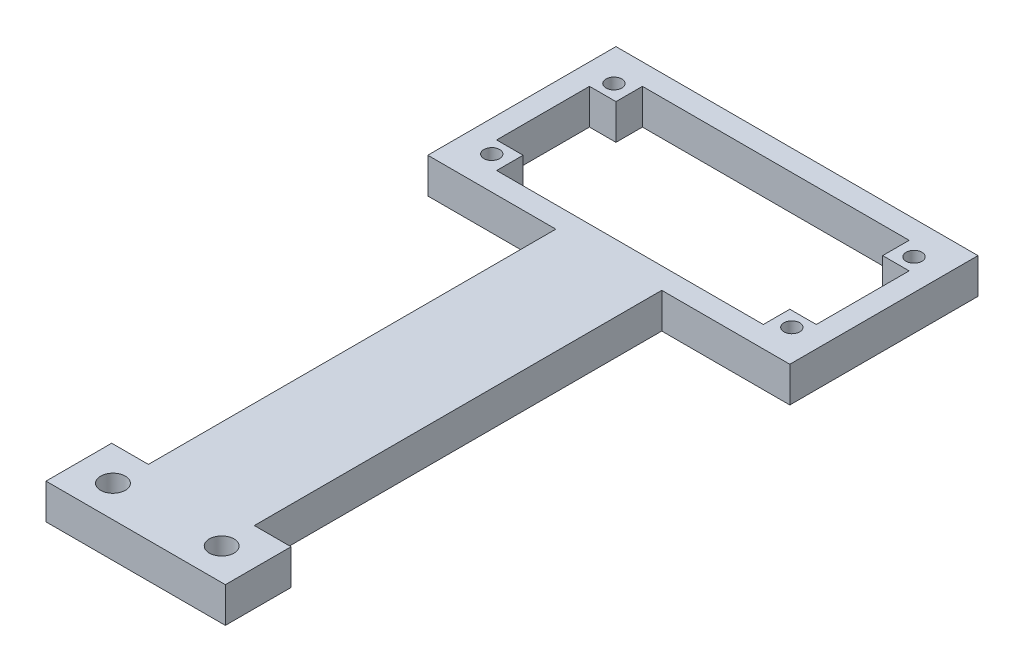
ISO-10303-21;
HEADER;
FILE_DESCRIPTION(('STEP AP214'),'2;1');
FILE_NAME('part.step','',(''),(''),'','','');
FILE_SCHEMA(('AUTOMOTIVE_DESIGN { 1 0 10303 214 1 1 1 1 }'));
ENDSEC;
DATA;
#1=APPLICATION_CONTEXT('core data for automotive mechanical design processes');
#2=APPLICATION_PROTOCOL_DEFINITION('international standard','automotive_design',2000,#1);
#3=PRODUCT_CONTEXT('',#1,'mechanical');
#4=PRODUCT('Part','Part','',(#3));
#5=PRODUCT_RELATED_PRODUCT_CATEGORY('part','',(#4));
#6=PRODUCT_DEFINITION_FORMATION('','',#4);
#7=PRODUCT_DEFINITION_CONTEXT('part definition',#1,'design');
#8=PRODUCT_DEFINITION('design','',#6,#7);
#9=PRODUCT_DEFINITION_SHAPE('','',#8);
#10=(LENGTH_UNIT() NAMED_UNIT(*) SI_UNIT(.MILLI.,.METRE.));
#11=(NAMED_UNIT(*) PLANE_ANGLE_UNIT() SI_UNIT($,.RADIAN.));
#12=(NAMED_UNIT(*) SI_UNIT($,.STERADIAN.) SOLID_ANGLE_UNIT());
#13=UNCERTAINTY_MEASURE_WITH_UNIT(LENGTH_MEASURE(1.E-05),#10,'distance_accuracy_value','');
#14=(GEOMETRIC_REPRESENTATION_CONTEXT(3) GLOBAL_UNCERTAINTY_ASSIGNED_CONTEXT((#13)) GLOBAL_UNIT_ASSIGNED_CONTEXT((#10,
#11,#12)) REPRESENTATION_CONTEXT('',''));
#15=CARTESIAN_POINT('',(0.,0.,0.));
#16=DIRECTION('',(0.,0.,1.));
#17=DIRECTION('',(1.,0.,0.));
#18=AXIS2_PLACEMENT_3D('',#15,#16,#17);
#19=CARTESIAN_POINT('',(-3.,5.,3.));
#20=DIRECTION('',(0.,0.,-1.));
#21=DIRECTION('',(-1.,0.,0.));
#22=AXIS2_PLACEMENT_3D('',#19,#20,#21);
#23=PLANE('',#22);
#24=DIRECTION('',(0.,1.,0.));
#25=VECTOR('',#24,1.);
#26=CARTESIAN_POINT('',(30.135,-59.6178664495804,3.));
#27=LINE('',#26,#25);
#28=CARTESIAN_POINT('',(30.135,0.,3.));
#29=VERTEX_POINT('',#28);
#30=CARTESIAN_POINT('',(30.135,5.,3.));
#31=VERTEX_POINT('',#30);
#32=EDGE_CURVE('E270',#29,#31,#27,.T.);
#33=ORIENTED_EDGE('',*,*,#32,.F.);
#34=DIRECTION('',(1.,0.,0.));
#35=VECTOR('',#34,1.);
#36=CARTESIAN_POINT('',(-3.,0.,3.));
#37=LINE('',#36,#35);
#38=CARTESIAN_POINT('',(48.27,0.,3.));
#39=VERTEX_POINT('',#38);
#40=EDGE_CURVE('E428',#29,#39,#37,.T.);
#41=ORIENTED_EDGE('',*,*,#40,.T.);
#42=DIRECTION('',(0.,-1.,0.));
#43=VECTOR('',#42,1.);
#44=CARTESIAN_POINT('',(48.27,5.,3.));
#45=LINE('',#44,#43);
#46=CARTESIAN_POINT('',(48.27,5.,3.));
#47=VERTEX_POINT('',#46);
#48=EDGE_CURVE('E11',#47,#39,#45,.T.);
#49=ORIENTED_EDGE('',*,*,#48,.F.);
#50=DIRECTION('',(1.,0.,0.));
#51=VECTOR('',#50,1.);
#52=CARTESIAN_POINT('',(-3.,5.,3.));
#53=LINE('',#52,#51);
#54=EDGE_CURVE('E446',#31,#47,#53,.T.);
#55=ORIENTED_EDGE('',*,*,#54,.F.);
#56=EDGE_LOOP('',(#33,#41,#49,#55));
#57=FACE_BOUND('',#56,.T.);
#58=ADVANCED_FACE('F39',(#57),#23,.F.);
#59=CARTESIAN_POINT('',(-3.,0.,3.));
#60=VERTEX_POINT('',#59);
#61=CARTESIAN_POINT('',(15.135,0.,3.));
#62=VERTEX_POINT('',#61);
#63=EDGE_CURVE('E456',#60,#62,#37,.T.);
#64=ORIENTED_EDGE('',*,*,#63,.T.);
#65=DIRECTION('',(0.,1.,0.));
#66=VECTOR('',#65,1.);
#67=CARTESIAN_POINT('',(15.135,-59.6178664495804,3.));
#68=LINE('',#67,#66);
#69=CARTESIAN_POINT('',(15.135,5.,3.));
#70=VERTEX_POINT('',#69);
#71=EDGE_CURVE('E63',#62,#70,#68,.T.);
#72=ORIENTED_EDGE('',*,*,#71,.T.);
#73=CARTESIAN_POINT('',(-3.,5.,3.));
#74=VERTEX_POINT('',#73);
#75=EDGE_CURVE('E442',#74,#70,#53,.T.);
#76=ORIENTED_EDGE('',*,*,#75,.F.);
#77=DIRECTION('',(0.,-1.,0.));
#78=VECTOR('',#77,1.);
#79=CARTESIAN_POINT('',(-3.,5.,3.));
#80=LINE('',#79,#78);
#81=EDGE_CURVE('E455',#74,#60,#80,.T.);
#82=ORIENTED_EDGE('',*,*,#81,.T.);
#83=EDGE_LOOP('',(#64,#72,#76,#82));
#84=FACE_BOUND('',#83,.T.);
#85=ADVANCED_FACE('F41',(#84),#23,.F.);
#86=CARTESIAN_POINT('',(48.27,5.,3.));
#87=DIRECTION('',(-1.,0.,0.));
#88=DIRECTION('',(0.,0.,1.));
#89=AXIS2_PLACEMENT_3D('',#86,#87,#88);
#90=PLANE('',#89);
#91=DIRECTION('',(0.,0.,-1.));
#92=VECTOR('',#91,1.);
#93=CARTESIAN_POINT('',(48.27,0.,3.));
#94=LINE('',#93,#92);
#95=CARTESIAN_POINT('',(48.27,0.,-23.65));
#96=VERTEX_POINT('',#95);
#97=EDGE_CURVE('E459',#39,#96,#94,.T.);
#98=ORIENTED_EDGE('',*,*,#97,.T.);
#99=DIRECTION('',(0.,-1.,0.));
#100=VECTOR('',#99,1.);
#101=CARTESIAN_POINT('',(48.27,5.,-23.65));
#102=LINE('',#101,#100);
#103=CARTESIAN_POINT('',(48.27,5.,-23.65));
#104=VERTEX_POINT('',#103);
#105=EDGE_CURVE('E48',#104,#96,#102,.T.);
#106=ORIENTED_EDGE('',*,*,#105,.F.);
#107=DIRECTION('',(0.,0.,-1.));
#108=VECTOR('',#107,1.);
#109=CARTESIAN_POINT('',(48.27,5.,3.));
#110=LINE('',#109,#108);
#111=EDGE_CURVE('E445',#47,#104,#110,.T.);
#112=ORIENTED_EDGE('',*,*,#111,.F.);
#113=ORIENTED_EDGE('',*,*,#48,.T.);
#114=EDGE_LOOP('',(#98,#106,#112,#113));
#115=FACE_BOUND('',#114,.T.);
#116=ADVANCED_FACE('F538',(#115),#90,.F.);
#117=CARTESIAN_POINT('',(48.27,5.,-23.65));
#118=DIRECTION('',(0.,0.,1.));
#119=DIRECTION('',(1.,0.,0.));
#120=AXIS2_PLACEMENT_3D('',#117,#118,#119);
#121=PLANE('',#120);
#122=DIRECTION('',(-1.,0.,0.));
#123=VECTOR('',#122,1.);
#124=CARTESIAN_POINT('',(48.27,0.,-23.65));
#125=LINE('',#124,#123);
#126=CARTESIAN_POINT('',(-3.,0.,-23.65));
#127=VERTEX_POINT('',#126);
#128=EDGE_CURVE('E462',#96,#127,#125,.T.);
#129=ORIENTED_EDGE('',*,*,#128,.T.);
#130=DIRECTION('',(0.,-1.,0.));
#131=VECTOR('',#130,1.);
#132=CARTESIAN_POINT('',(-3.,5.,-23.65));
#133=LINE('',#132,#131);
#134=CARTESIAN_POINT('',(-3.,5.,-23.65));
#135=VERTEX_POINT('',#134);
#136=EDGE_CURVE('E471',#135,#127,#133,.T.);
#137=ORIENTED_EDGE('',*,*,#136,.F.);
#138=DIRECTION('',(-1.,0.,0.));
#139=VECTOR('',#138,1.);
#140=CARTESIAN_POINT('',(48.27,5.,-23.65));
#141=LINE('',#140,#139);
#142=EDGE_CURVE('E449',#104,#135,#141,.T.);
#143=ORIENTED_EDGE('',*,*,#142,.F.);
#144=ORIENTED_EDGE('',*,*,#105,.T.);
#145=EDGE_LOOP('',(#129,#137,#143,#144));
#146=FACE_BOUND('',#145,.T.);
#147=ADVANCED_FACE('F480',(#146),#121,.F.);
#148=CARTESIAN_POINT('',(-3.,5.,-23.65));
#149=DIRECTION('',(1.,0.,0.));
#150=DIRECTION('',(0.,0.,-1.));
#151=AXIS2_PLACEMENT_3D('',#148,#149,#150);
#152=PLANE('',#151);
#153=DIRECTION('',(0.,0.,1.));
#154=VECTOR('',#153,1.);
#155=CARTESIAN_POINT('',(-3.,0.,-23.65));
#156=LINE('',#155,#154);
#157=EDGE_CURVE('E465',#127,#60,#156,.T.);
#158=ORIENTED_EDGE('',*,*,#157,.T.);
#159=ORIENTED_EDGE('',*,*,#81,.F.);
#160=DIRECTION('',(0.,0.,1.));
#161=VECTOR('',#160,1.);
#162=CARTESIAN_POINT('',(-3.,5.,-23.65));
#163=LINE('',#162,#161);
#164=EDGE_CURVE('E452',#135,#74,#163,.T.);
#165=ORIENTED_EDGE('',*,*,#164,.F.);
#166=ORIENTED_EDGE('',*,*,#136,.T.);
#167=EDGE_LOOP('',(#158,#159,#165,#166));
#168=FACE_BOUND('',#167,.T.);
#169=ADVANCED_FACE('F490',(#168),#152,.F.);
#170=CARTESIAN_POINT('',(0.,5.,0.));
#171=DIRECTION('',(0.,1.,0.));
#172=DIRECTION('',(0.,0.,1.));
#173=AXIS2_PLACEMENT_3D('',#170,#171,#172);
#174=PLANE('',#173);
#175=DIRECTION('',(-1.,0.,0.));
#176=VECTOR('',#175,1.);
#177=CARTESIAN_POINT('',(9.93500000000002,5.,70.));
#178=LINE('',#177,#176);
#179=CARTESIAN_POINT('',(35.335,5.,70.));
#180=VERTEX_POINT('',#179);
#181=CARTESIAN_POINT('',(9.93500000000002,5.,70.));
#182=VERTEX_POINT('',#181);
#183=EDGE_CURVE('E203',#180,#182,#178,.T.);
#184=ORIENTED_EDGE('',*,*,#183,.F.);
#185=DIRECTION('',(0.,0.,-1.));
#186=VECTOR('',#185,1.);
#187=CARTESIAN_POINT('',(35.335,5.,60.7));
#188=LINE('',#187,#186);
#189=CARTESIAN_POINT('',(35.335,5.,60.7));
#190=VERTEX_POINT('',#189);
#191=EDGE_CURVE('E242',#180,#190,#188,.T.);
#192=ORIENTED_EDGE('',*,*,#191,.T.);
#193=DIRECTION('',(-1.,0.,0.));
#194=VECTOR('',#193,1.);
#195=CARTESIAN_POINT('',(9.93500000000002,5.,60.7));
#196=LINE('',#195,#194);
#197=CARTESIAN_POINT('',(30.135,5.,60.7));
#198=VERTEX_POINT('',#197);
#199=EDGE_CURVE('E247',#190,#198,#196,.T.);
#200=ORIENTED_EDGE('',*,*,#199,.T.);
#201=DIRECTION('',(0.,0.,-1.));
#202=VECTOR('',#201,1.);
#203=CARTESIAN_POINT('',(30.135,5.,3.));
#204=LINE('',#203,#202);
#205=EDGE_CURVE('E227',#198,#31,#204,.T.);
#206=ORIENTED_EDGE('',*,*,#205,.T.);
#207=ORIENTED_EDGE('',*,*,#54,.T.);
#208=ORIENTED_EDGE('',*,*,#111,.T.);
#209=ORIENTED_EDGE('',*,*,#142,.T.);
#210=ORIENTED_EDGE('',*,*,#164,.T.);
#211=ORIENTED_EDGE('',*,*,#75,.T.);
#212=DIRECTION('',(0.,0.,1.));
#213=VECTOR('',#212,1.);
#214=CARTESIAN_POINT('',(15.135,5.,3.));
#215=LINE('',#214,#213);
#216=CARTESIAN_POINT('',(15.135,5.,60.7));
#217=VERTEX_POINT('',#216);
#218=EDGE_CURVE('E233',#70,#217,#215,.T.);
#219=ORIENTED_EDGE('',*,*,#218,.T.);
#220=CARTESIAN_POINT('',(9.93500000000002,5.,60.7));
#221=VERTEX_POINT('',#220);
#222=EDGE_CURVE('E246',#217,#221,#196,.T.);
#223=ORIENTED_EDGE('',*,*,#222,.T.);
#224=DIRECTION('',(0.,0.,1.));
#225=VECTOR('',#224,1.);
#226=CARTESIAN_POINT('',(9.93500000000002,5.,60.7));
#227=LINE('',#226,#225);
#228=EDGE_CURVE('E239',#221,#182,#227,.T.);
#229=ORIENTED_EDGE('',*,*,#228,.T.);
#230=EDGE_LOOP('',(#184,#192,#200,#206,#207,#208,#209,#210,#211,#219,#223,#229));
#231=FACE_BOUND('',#230,.T.);
#232=CARTESIAN_POINT('',(30.335,5.,65.5177703204061));
#233=DIRECTION('',(0.,-1.,0.));
#234=DIRECTION('',(0.,0.,-1.));
#235=AXIS2_PLACEMENT_3D('',#232,#233,#234);
#236=CIRCLE('',#235,1.75);
#237=CARTESIAN_POINT('',(30.335,5.,63.7677703204061));
#238=VERTEX_POINT('',#237);
#239=EDGE_CURVE('E243',#238,#238,#236,.T.);
#240=ORIENTED_EDGE('',*,*,#239,.T.);
#241=EDGE_LOOP('',(#240));
#242=FACE_BOUND('',#241,.T.);
#243=CARTESIAN_POINT('',(14.935,5.,65.5177703204061));
#244=DIRECTION('',(0.,-1.,0.));
#245=DIRECTION('',(0.,0.,-1.));
#246=AXIS2_PLACEMENT_3D('',#243,#244,#245);
#247=CIRCLE('',#246,1.75);
#248=CARTESIAN_POINT('',(14.935,5.,63.7677703204061));
#249=VERTEX_POINT('',#248);
#250=EDGE_CURVE('E509',#249,#249,#247,.T.);
#251=ORIENTED_EDGE('',*,*,#250,.T.);
#252=EDGE_LOOP('',(#251));
#253=FACE_BOUND('',#252,.T.);
#254=CARTESIAN_POINT('',(1.385,5.,-1.675));
#255=DIRECTION('',(0.,1.,0.));
#256=DIRECTION('',(0.,0.,1.));
#257=AXIS2_PLACEMENT_3D('',#254,#255,#256);
#258=CIRCLE('',#257,1.12);
#259=CARTESIAN_POINT('',(1.385,5.,-0.555000000000001));
#260=VERTEX_POINT('',#259);
#261=EDGE_CURVE('E265',#260,#260,#258,.T.);
#262=ORIENTED_EDGE('',*,*,#261,.F.);
#263=EDGE_LOOP('',(#262));
#264=FACE_BOUND('',#263,.T.);
#265=CARTESIAN_POINT('',(43.885,5.,-1.675));
#266=DIRECTION('',(0.,1.,0.));
#267=DIRECTION('',(0.,0.,1.));
#268=AXIS2_PLACEMENT_3D('',#265,#266,#267);
#269=CIRCLE('',#268,1.12000000000001);
#270=CARTESIAN_POINT('',(43.885,5.,-0.554999999999996));
#271=VERTEX_POINT('',#270);
#272=EDGE_CURVE('E295',#271,#271,#269,.T.);
#273=ORIENTED_EDGE('',*,*,#272,.F.);
#274=EDGE_LOOP('',(#273));
#275=FACE_BOUND('',#274,.T.);
#276=CARTESIAN_POINT('',(43.885,5.,-18.975));
#277=DIRECTION('',(0.,1.,0.));
#278=DIRECTION('',(0.,0.,1.));
#279=AXIS2_PLACEMENT_3D('',#276,#277,#278);
#280=CIRCLE('',#279,1.12);
#281=CARTESIAN_POINT('',(43.885,5.,-17.855));
#282=VERTEX_POINT('',#281);
#283=EDGE_CURVE('E287',#282,#282,#280,.T.);
#284=ORIENTED_EDGE('',*,*,#283,.F.);
#285=EDGE_LOOP('',(#284));
#286=FACE_BOUND('',#285,.T.);
#287=CARTESIAN_POINT('',(1.385,5.,-18.975));
#288=DIRECTION('',(0.,1.,0.));
#289=DIRECTION('',(0.,0.,1.));
#290=AXIS2_PLACEMENT_3D('',#287,#288,#289);
#291=CIRCLE('',#290,1.12);
#292=CARTESIAN_POINT('',(1.385,5.,-17.855));
#293=VERTEX_POINT('',#292);
#294=EDGE_CURVE('E286',#293,#293,#291,.T.);
#295=ORIENTED_EDGE('',*,*,#294,.F.);
#296=EDGE_LOOP('',(#295));
#297=FACE_BOUND('',#296,.T.);
#298=DIRECTION('',(-1.,0.,0.));
#299=VECTOR('',#298,1.);
#300=CARTESIAN_POINT('',(0.,5.,-20.65));
#301=LINE('',#300,#299);
#302=CARTESIAN_POINT('',(41.52,5.,-20.65));
#303=VERTEX_POINT('',#302);
#304=CARTESIAN_POINT('',(3.75,5.,-20.65));
#305=VERTEX_POINT('',#304);
#306=EDGE_CURVE('E417',#303,#305,#301,.T.);
#307=ORIENTED_EDGE('',*,*,#306,.F.);
#308=DIRECTION('',(0.,0.,1.));
#309=VECTOR('',#308,1.);
#310=CARTESIAN_POINT('',(41.52,5.,-20.65));
#311=LINE('',#310,#309);
#312=CARTESIAN_POINT('',(41.52,5.,-16.9));
#313=VERTEX_POINT('',#312);
#314=EDGE_CURVE('E310',#303,#313,#311,.T.);
#315=ORIENTED_EDGE('',*,*,#314,.T.);
#316=DIRECTION('',(1.,0.,0.));
#317=VECTOR('',#316,1.);
#318=CARTESIAN_POINT('',(45.27,5.,-16.9));
#319=LINE('',#318,#317);
#320=CARTESIAN_POINT('',(45.27,5.,-16.9));
#321=VERTEX_POINT('',#320);
#322=EDGE_CURVE('E325',#313,#321,#319,.T.);
#323=ORIENTED_EDGE('',*,*,#322,.T.);
#324=DIRECTION('',(0.,0.,-1.));
#325=VECTOR('',#324,1.);
#326=CARTESIAN_POINT('',(45.27,5.,0.));
#327=LINE('',#326,#325);
#328=CARTESIAN_POINT('',(45.27,5.,-3.75));
#329=VERTEX_POINT('',#328);
#330=EDGE_CURVE('E436',#329,#321,#327,.T.);
#331=ORIENTED_EDGE('',*,*,#330,.F.);
#332=DIRECTION('',(-1.,0.,0.));
#333=VECTOR('',#332,1.);
#334=CARTESIAN_POINT('',(45.27,5.,-3.75));
#335=LINE('',#334,#333);
#336=CARTESIAN_POINT('',(41.52,5.,-3.75));
#337=VERTEX_POINT('',#336);
#338=EDGE_CURVE('E321',#329,#337,#335,.T.);
#339=ORIENTED_EDGE('',*,*,#338,.T.);
#340=DIRECTION('',(0.,0.,1.));
#341=VECTOR('',#340,1.);
#342=CARTESIAN_POINT('',(41.52,5.,0.));
#343=LINE('',#342,#341);
#344=CARTESIAN_POINT('',(41.52,5.,0.));
#345=VERTEX_POINT('',#344);
#346=EDGE_CURVE('E346',#337,#345,#343,.T.);
#347=ORIENTED_EDGE('',*,*,#346,.T.);
#348=DIRECTION('',(1.,0.,0.));
#349=VECTOR('',#348,1.);
#350=CARTESIAN_POINT('',(0.,5.,0.));
#351=LINE('',#350,#349);
#352=CARTESIAN_POINT('',(3.75,5.,0.));
#353=VERTEX_POINT('',#352);
#354=EDGE_CURVE('E432',#353,#345,#351,.T.);
#355=ORIENTED_EDGE('',*,*,#354,.F.);
#356=DIRECTION('',(0.,0.,-1.));
#357=VECTOR('',#356,1.);
#358=CARTESIAN_POINT('',(3.75,5.,0.));
#359=LINE('',#358,#357);
#360=CARTESIAN_POINT('',(3.75,5.,-3.74999999999999));
#361=VERTEX_POINT('',#360);
#362=EDGE_CURVE('E361',#353,#361,#359,.T.);
#363=ORIENTED_EDGE('',*,*,#362,.T.);
#364=DIRECTION('',(-1.,0.,0.));
#365=VECTOR('',#364,1.);
#366=CARTESIAN_POINT('',(0.,5.,-3.74999999999999));
#367=LINE('',#366,#365);
#368=CARTESIAN_POINT('',(0.,5.,-3.74999999999999));
#369=VERTEX_POINT('',#368);
#370=EDGE_CURVE('E374',#361,#369,#367,.T.);
#371=ORIENTED_EDGE('',*,*,#370,.T.);
#372=DIRECTION('',(0.,0.,1.));
#373=VECTOR('',#372,1.);
#374=CARTESIAN_POINT('',(0.,5.,0.));
#375=LINE('',#374,#373);
#376=CARTESIAN_POINT('',(0.,5.,-16.9));
#377=VERTEX_POINT('',#376);
#378=EDGE_CURVE('E411',#377,#369,#375,.T.);
#379=ORIENTED_EDGE('',*,*,#378,.F.);
#380=DIRECTION('',(1.,0.,0.));
#381=VECTOR('',#380,1.);
#382=CARTESIAN_POINT('',(0.,5.,-16.9));
#383=LINE('',#382,#381);
#384=CARTESIAN_POINT('',(3.75,5.,-16.9));
#385=VERTEX_POINT('',#384);
#386=EDGE_CURVE('E370',#377,#385,#383,.T.);
#387=ORIENTED_EDGE('',*,*,#386,.T.);
#388=DIRECTION('',(0.,0.,-1.));
#389=VECTOR('',#388,1.);
#390=CARTESIAN_POINT('',(3.75,5.,-20.65));
#391=LINE('',#390,#389);
#392=EDGE_CURVE('E395',#385,#305,#391,.T.);
#393=ORIENTED_EDGE('',*,*,#392,.T.);
#394=EDGE_LOOP('',(#307,#315,#323,#331,#339,#347,#355,#363,#371,#379,#387,#393));
#395=FACE_BOUND('',#394,.T.);
#396=ADVANCED_FACE('F494',(#231,#242,#253,#264,#275,#286,#297,#395),#174,.T.);
#397=CARTESIAN_POINT('',(0.,0.,0.));
#398=DIRECTION('',(0.,1.,0.));
#399=DIRECTION('',(0.,0.,1.));
#400=AXIS2_PLACEMENT_3D('',#397,#398,#399);
#401=PLANE('',#400);
#402=CARTESIAN_POINT('',(30.335,0.,65.5177703204061));
#403=DIRECTION('',(0.,-1.,0.));
#404=DIRECTION('',(0.,0.,-1.));
#405=AXIS2_PLACEMENT_3D('',#402,#403,#404);
#406=CIRCLE('',#405,1.75);
#407=CARTESIAN_POINT('',(30.335,0.,63.7677703204061));
#408=VERTEX_POINT('',#407);
#409=EDGE_CURVE('E505',#408,#408,#406,.T.);
#410=ORIENTED_EDGE('',*,*,#409,.F.);
#411=EDGE_LOOP('',(#410));
#412=FACE_BOUND('',#411,.T.);
#413=CARTESIAN_POINT('',(14.935,0.,65.5177703204061));
#414=DIRECTION('',(0.,-1.,0.));
#415=DIRECTION('',(0.,0.,-1.));
#416=AXIS2_PLACEMENT_3D('',#413,#414,#415);
#417=CIRCLE('',#416,1.75);
#418=CARTESIAN_POINT('',(14.935,0.,63.7677703204061));
#419=VERTEX_POINT('',#418);
#420=EDGE_CURVE('E209',#419,#419,#417,.T.);
#421=ORIENTED_EDGE('',*,*,#420,.F.);
#422=EDGE_LOOP('',(#421));
#423=FACE_BOUND('',#422,.T.);
#424=CARTESIAN_POINT('',(1.385,0.,-1.675));
#425=DIRECTION('',(0.,1.,0.));
#426=DIRECTION('',(0.,0.,1.));
#427=AXIS2_PLACEMENT_3D('',#424,#425,#426);
#428=CIRCLE('',#427,1.12);
#429=CARTESIAN_POINT('',(1.385,0.,-0.555000000000001));
#430=VERTEX_POINT('',#429);
#431=EDGE_CURVE('E299',#430,#430,#428,.T.);
#432=ORIENTED_EDGE('',*,*,#431,.T.);
#433=EDGE_LOOP('',(#432));
#434=FACE_BOUND('',#433,.T.);
#435=CARTESIAN_POINT('',(43.885,0.,-1.675));
#436=DIRECTION('',(0.,1.,0.));
#437=DIRECTION('',(0.,0.,1.));
#438=AXIS2_PLACEMENT_3D('',#435,#436,#437);
#439=CIRCLE('',#438,1.12000000000001);
#440=CARTESIAN_POINT('',(43.885,0.,-0.554999999999996));
#441=VERTEX_POINT('',#440);
#442=EDGE_CURVE('E291',#441,#441,#439,.T.);
#443=ORIENTED_EDGE('',*,*,#442,.T.);
#444=EDGE_LOOP('',(#443));
#445=FACE_BOUND('',#444,.T.);
#446=CARTESIAN_POINT('',(43.885,0.,-18.975));
#447=DIRECTION('',(0.,1.,0.));
#448=DIRECTION('',(0.,0.,1.));
#449=AXIS2_PLACEMENT_3D('',#446,#447,#448);
#450=CIRCLE('',#449,1.12);
#451=CARTESIAN_POINT('',(43.885,0.,-17.855));
#452=VERTEX_POINT('',#451);
#453=EDGE_CURVE('E282',#452,#452,#450,.T.);
#454=ORIENTED_EDGE('',*,*,#453,.T.);
#455=EDGE_LOOP('',(#454));
#456=FACE_BOUND('',#455,.T.);
#457=CARTESIAN_POINT('',(1.385,0.,-18.975));
#458=DIRECTION('',(0.,1.,0.));
#459=DIRECTION('',(0.,0.,1.));
#460=AXIS2_PLACEMENT_3D('',#457,#458,#459);
#461=CIRCLE('',#460,1.12);
#462=CARTESIAN_POINT('',(1.385,0.,-17.855));
#463=VERTEX_POINT('',#462);
#464=EDGE_CURVE('E306',#463,#463,#461,.T.);
#465=ORIENTED_EDGE('',*,*,#464,.T.);
#466=EDGE_LOOP('',(#465));
#467=FACE_BOUND('',#466,.T.);
#468=DIRECTION('',(0.,0.,-1.));
#469=VECTOR('',#468,1.);
#470=CARTESIAN_POINT('',(41.52,0.,-20.65));
#471=LINE('',#470,#469);
#472=CARTESIAN_POINT('',(41.52,0.,-16.9));
#473=VERTEX_POINT('',#472);
#474=CARTESIAN_POINT('',(41.52,0.,-20.65));
#475=VERTEX_POINT('',#474);
#476=EDGE_CURVE('E314',#473,#475,#471,.T.);
#477=ORIENTED_EDGE('',*,*,#476,.T.);
#478=DIRECTION('',(-1.,0.,0.));
#479=VECTOR('',#478,1.);
#480=CARTESIAN_POINT('',(0.,0.,-20.65));
#481=LINE('',#480,#479);
#482=CARTESIAN_POINT('',(3.75,0.,-20.65));
#483=VERTEX_POINT('',#482);
#484=EDGE_CURVE('E425',#475,#483,#481,.T.);
#485=ORIENTED_EDGE('',*,*,#484,.T.);
#486=DIRECTION('',(0.,0.,1.));
#487=VECTOR('',#486,1.);
#488=CARTESIAN_POINT('',(3.75,0.,-20.65));
#489=LINE('',#488,#487);
#490=CARTESIAN_POINT('',(3.75,0.,-16.9));
#491=VERTEX_POINT('',#490);
#492=EDGE_CURVE('E387',#483,#491,#489,.T.);
#493=ORIENTED_EDGE('',*,*,#492,.T.);
#494=DIRECTION('',(-1.,0.,0.));
#495=VECTOR('',#494,1.);
#496=CARTESIAN_POINT('',(0.,0.,-16.9));
#497=LINE('',#496,#495);
#498=CARTESIAN_POINT('',(0.,0.,-16.9));
#499=VERTEX_POINT('',#498);
#500=EDGE_CURVE('E390',#491,#499,#497,.T.);
#501=ORIENTED_EDGE('',*,*,#500,.T.);
#502=DIRECTION('',(0.,0.,1.));
#503=VECTOR('',#502,1.);
#504=CARTESIAN_POINT('',(0.,0.,0.));
#505=LINE('',#504,#503);
#506=CARTESIAN_POINT('',(0.,0.,-3.74999999999999));
#507=VERTEX_POINT('',#506);
#508=EDGE_CURVE('E412',#499,#507,#505,.T.);
#509=ORIENTED_EDGE('',*,*,#508,.T.);
#510=DIRECTION('',(1.,0.,0.));
#511=VECTOR('',#510,1.);
#512=CARTESIAN_POINT('',(0.,0.,-3.74999999999999));
#513=LINE('',#512,#511);
#514=CARTESIAN_POINT('',(3.75,0.,-3.74999999999999));
#515=VERTEX_POINT('',#514);
#516=EDGE_CURVE('E366',#507,#515,#513,.T.);
#517=ORIENTED_EDGE('',*,*,#516,.T.);
#518=DIRECTION('',(0.,0.,1.));
#519=VECTOR('',#518,1.);
#520=CARTESIAN_POINT('',(3.75,0.,0.));
#521=LINE('',#520,#519);
#522=CARTESIAN_POINT('',(3.75,0.,0.));
#523=VERTEX_POINT('',#522);
#524=EDGE_CURVE('E362',#515,#523,#521,.T.);
#525=ORIENTED_EDGE('',*,*,#524,.T.);
#526=DIRECTION('',(1.,0.,0.));
#527=VECTOR('',#526,1.);
#528=CARTESIAN_POINT('',(0.,0.,0.));
#529=LINE('',#528,#527);
#530=CARTESIAN_POINT('',(41.52,0.,0.));
#531=VERTEX_POINT('',#530);
#532=EDGE_CURVE('E416',#523,#531,#529,.T.);
#533=ORIENTED_EDGE('',*,*,#532,.T.);
#534=DIRECTION('',(0.,0.,-1.));
#535=VECTOR('',#534,1.);
#536=CARTESIAN_POINT('',(41.52,0.,0.));
#537=LINE('',#536,#535);
#538=CARTESIAN_POINT('',(41.52,0.,-3.75));
#539=VERTEX_POINT('',#538);
#540=EDGE_CURVE('E338',#531,#539,#537,.T.);
#541=ORIENTED_EDGE('',*,*,#540,.T.);
#542=DIRECTION('',(1.,0.,0.));
#543=VECTOR('',#542,1.);
#544=CARTESIAN_POINT('',(45.27,0.,-3.75));
#545=LINE('',#544,#543);
#546=CARTESIAN_POINT('',(45.27,0.,-3.75));
#547=VERTEX_POINT('',#546);
#548=EDGE_CURVE('E341',#539,#547,#545,.T.);
#549=ORIENTED_EDGE('',*,*,#548,.T.);
#550=DIRECTION('',(0.,0.,-1.));
#551=VECTOR('',#550,1.);
#552=CARTESIAN_POINT('',(45.27,0.,0.));
#553=LINE('',#552,#551);
#554=CARTESIAN_POINT('',(45.27,0.,-16.9));
#555=VERTEX_POINT('',#554);
#556=EDGE_CURVE('E421',#547,#555,#553,.T.);
#557=ORIENTED_EDGE('',*,*,#556,.T.);
#558=DIRECTION('',(-1.,0.,0.));
#559=VECTOR('',#558,1.);
#560=CARTESIAN_POINT('',(45.27,0.,-16.9));
#561=LINE('',#560,#559);
#562=EDGE_CURVE('E317',#555,#473,#561,.T.);
#563=ORIENTED_EDGE('',*,*,#562,.T.);
#564=EDGE_LOOP('',(#477,#485,#493,#501,#509,#517,#525,#533,#541,#549,#557,#563));
#565=FACE_BOUND('',#564,.T.);
#566=DIRECTION('',(0.,0.,1.));
#567=VECTOR('',#566,1.);
#568=CARTESIAN_POINT('',(35.335,0.,60.7));
#569=LINE('',#568,#567);
#570=CARTESIAN_POINT('',(35.335,0.,60.7));
#571=VERTEX_POINT('',#570);
#572=CARTESIAN_POINT('',(35.335,0.,70.));
#573=VERTEX_POINT('',#572);
#574=EDGE_CURVE('E219',#571,#573,#569,.T.);
#575=ORIENTED_EDGE('',*,*,#574,.T.);
#576=DIRECTION('',(-1.,0.,0.));
#577=VECTOR('',#576,1.);
#578=CARTESIAN_POINT('',(9.93500000000002,0.,70.));
#579=LINE('',#578,#577);
#580=CARTESIAN_POINT('',(9.93500000000002,0.,70.));
#581=VERTEX_POINT('',#580);
#582=EDGE_CURVE('E55',#573,#581,#579,.T.);
#583=ORIENTED_EDGE('',*,*,#582,.T.);
#584=DIRECTION('',(0.,0.,-1.));
#585=VECTOR('',#584,1.);
#586=CARTESIAN_POINT('',(9.93500000000002,0.,60.7));
#587=LINE('',#586,#585);
#588=CARTESIAN_POINT('',(9.93500000000002,0.,60.7));
#589=VERTEX_POINT('',#588);
#590=EDGE_CURVE('E216',#581,#589,#587,.T.);
#591=ORIENTED_EDGE('',*,*,#590,.T.);
#592=DIRECTION('',(1.,0.,0.));
#593=VECTOR('',#592,1.);
#594=CARTESIAN_POINT('',(9.93500000000002,0.,60.7));
#595=LINE('',#594,#593);
#596=CARTESIAN_POINT('',(15.135,0.,60.7));
#597=VERTEX_POINT('',#596);
#598=EDGE_CURVE('E228',#589,#597,#595,.T.);
#599=ORIENTED_EDGE('',*,*,#598,.T.);
#600=DIRECTION('',(0.,0.,-1.));
#601=VECTOR('',#600,1.);
#602=CARTESIAN_POINT('',(15.135,0.,3.));
#603=LINE('',#602,#601);
#604=EDGE_CURVE('E257',#597,#62,#603,.T.);
#605=ORIENTED_EDGE('',*,*,#604,.T.);
#606=ORIENTED_EDGE('',*,*,#63,.F.);
#607=ORIENTED_EDGE('',*,*,#157,.F.);
#608=ORIENTED_EDGE('',*,*,#128,.F.);
#609=ORIENTED_EDGE('',*,*,#97,.F.);
#610=ORIENTED_EDGE('',*,*,#40,.F.);
#611=DIRECTION('',(0.,0.,1.));
#612=VECTOR('',#611,1.);
#613=CARTESIAN_POINT('',(30.135,0.,3.));
#614=LINE('',#613,#612);
#615=CARTESIAN_POINT('',(30.135,0.,60.7));
#616=VERTEX_POINT('',#615);
#617=EDGE_CURVE('E261',#29,#616,#614,.T.);
#618=ORIENTED_EDGE('',*,*,#617,.T.);
#619=EDGE_CURVE('E235',#616,#571,#595,.T.);
#620=ORIENTED_EDGE('',*,*,#619,.T.);
#621=EDGE_LOOP('',(#575,#583,#591,#599,#605,#606,#607,#608,#609,#610,#618,#620));
#622=FACE_BOUND('',#621,.T.);
#623=ADVANCED_FACE('F214',(#412,#423,#434,#445,#456,#467,#565,#622),#401,.F.);
#624=CARTESIAN_POINT('',(0.,0.,0.));
#625=DIRECTION('',(-1.,0.,0.));
#626=DIRECTION('',(0.,0.,1.));
#627=AXIS2_PLACEMENT_3D('',#624,#625,#626);
#628=PLANE('',#627);
#629=ORIENTED_EDGE('',*,*,#378,.T.);
#630=DIRECTION('',(0.,1.,0.));
#631=VECTOR('',#630,1.);
#632=CARTESIAN_POINT('',(0.,-5.30330085889911,-3.74999999999999));
#633=LINE('',#632,#631);
#634=EDGE_CURVE('E367',#507,#369,#633,.T.);
#635=ORIENTED_EDGE('',*,*,#634,.F.);
#636=ORIENTED_EDGE('',*,*,#508,.F.);
#637=DIRECTION('',(0.,1.,0.));
#638=VECTOR('',#637,1.);
#639=CARTESIAN_POINT('',(0.,-5.30330085889911,-16.9));
#640=LINE('',#639,#638);
#641=EDGE_CURVE('E399',#499,#377,#640,.T.);
#642=ORIENTED_EDGE('',*,*,#641,.T.);
#643=EDGE_LOOP('',(#629,#635,#636,#642));
#644=FACE_BOUND('',#643,.T.);
#645=ADVANCED_FACE('F633',(#644),#628,.F.);
#646=CARTESIAN_POINT('',(0.,0.,-20.65));
#647=DIRECTION('',(0.,0.,-1.));
#648=DIRECTION('',(-1.,0.,0.));
#649=AXIS2_PLACEMENT_3D('',#646,#647,#648);
#650=PLANE('',#649);
#651=ORIENTED_EDGE('',*,*,#484,.F.);
#652=DIRECTION('',(0.,1.,0.));
#653=VECTOR('',#652,1.);
#654=CARTESIAN_POINT('',(41.52,-5.30330085889911,-20.65));
#655=LINE('',#654,#653);
#656=EDGE_CURVE('E329',#475,#303,#655,.T.);
#657=ORIENTED_EDGE('',*,*,#656,.T.);
#658=ORIENTED_EDGE('',*,*,#306,.T.);
#659=DIRECTION('',(0.,1.,0.));
#660=VECTOR('',#659,1.);
#661=CARTESIAN_POINT('',(3.75,-5.30330085889911,-20.65));
#662=LINE('',#661,#660);
#663=EDGE_CURVE('E391',#483,#305,#662,.T.);
#664=ORIENTED_EDGE('',*,*,#663,.F.);
#665=EDGE_LOOP('',(#651,#657,#658,#664));
#666=FACE_BOUND('',#665,.T.);
#667=ADVANCED_FACE('F704',(#666),#650,.F.);
#668=CARTESIAN_POINT('',(45.27,0.,0.));
#669=DIRECTION('',(1.,0.,0.));
#670=DIRECTION('',(0.,0.,-1.));
#671=AXIS2_PLACEMENT_3D('',#668,#669,#670);
#672=PLANE('',#671);
#673=ORIENTED_EDGE('',*,*,#330,.T.);
#674=DIRECTION('',(0.,1.,0.));
#675=VECTOR('',#674,1.);
#676=CARTESIAN_POINT('',(45.27,-5.30330085889911,-16.9));
#677=LINE('',#676,#675);
#678=EDGE_CURVE('E318',#555,#321,#677,.T.);
#679=ORIENTED_EDGE('',*,*,#678,.F.);
#680=ORIENTED_EDGE('',*,*,#556,.F.);
#681=DIRECTION('',(0.,1.,0.));
#682=VECTOR('',#681,1.);
#683=CARTESIAN_POINT('',(45.27,-5.30330085889911,-3.75));
#684=LINE('',#683,#682);
#685=EDGE_CURVE('E350',#547,#329,#684,.T.);
#686=ORIENTED_EDGE('',*,*,#685,.T.);
#687=EDGE_LOOP('',(#673,#679,#680,#686));
#688=FACE_BOUND('',#687,.T.);
#689=ADVANCED_FACE('F707',(#688),#672,.F.);
#690=CARTESIAN_POINT('',(0.,0.,0.));
#691=DIRECTION('',(0.,0.,1.));
#692=DIRECTION('',(1.,0.,0.));
#693=AXIS2_PLACEMENT_3D('',#690,#691,#692);
#694=PLANE('',#693);
#695=ORIENTED_EDGE('',*,*,#354,.T.);
#696=DIRECTION('',(0.,1.,0.));
#697=VECTOR('',#696,1.);
#698=CARTESIAN_POINT('',(41.52,-5.30330085889911,0.));
#699=LINE('',#698,#697);
#700=EDGE_CURVE('E342',#531,#345,#699,.T.);
#701=ORIENTED_EDGE('',*,*,#700,.F.);
#702=ORIENTED_EDGE('',*,*,#532,.F.);
#703=DIRECTION('',(0.,1.,0.));
#704=VECTOR('',#703,1.);
#705=CARTESIAN_POINT('',(3.75,-5.30330085889911,0.));
#706=LINE('',#705,#704);
#707=EDGE_CURVE('E378',#523,#353,#706,.T.);
#708=ORIENTED_EDGE('',*,*,#707,.T.);
#709=EDGE_LOOP('',(#695,#701,#702,#708));
#710=FACE_BOUND('',#709,.T.);
#711=ADVANCED_FACE('F699',(#710),#694,.F.);
#712=CARTESIAN_POINT('',(3.75,-5.30330085889911,-20.65));
#713=DIRECTION('',(1.,0.,0.));
#714=DIRECTION('',(0.,0.,-1.));
#715=AXIS2_PLACEMENT_3D('',#712,#713,#714);
#716=PLANE('',#715);
#717=ORIENTED_EDGE('',*,*,#492,.F.);
#718=ORIENTED_EDGE('',*,*,#663,.T.);
#719=ORIENTED_EDGE('',*,*,#392,.F.);
#720=DIRECTION('',(0.,1.,0.));
#721=VECTOR('',#720,1.);
#722=CARTESIAN_POINT('',(3.75,-5.30330085889911,-16.9));
#723=LINE('',#722,#721);
#724=EDGE_CURVE('E403',#491,#385,#723,.T.);
#725=ORIENTED_EDGE('',*,*,#724,.F.);
#726=EDGE_LOOP('',(#717,#718,#719,#725));
#727=FACE_BOUND('',#726,.T.);
#728=ADVANCED_FACE('F696',(#727),#716,.T.);
#729=CARTESIAN_POINT('',(0.,-5.30330085889911,-16.9));
#730=DIRECTION('',(0.,0.,1.));
#731=DIRECTION('',(1.,0.,0.));
#732=AXIS2_PLACEMENT_3D('',#729,#730,#731);
#733=PLANE('',#732);
#734=ORIENTED_EDGE('',*,*,#500,.F.);
#735=ORIENTED_EDGE('',*,*,#724,.T.);
#736=ORIENTED_EDGE('',*,*,#386,.F.);
#737=ORIENTED_EDGE('',*,*,#641,.F.);
#738=EDGE_LOOP('',(#734,#735,#736,#737));
#739=FACE_BOUND('',#738,.T.);
#740=ADVANCED_FACE('F691',(#739),#733,.T.);
#741=CARTESIAN_POINT('',(0.,-5.30330085889911,-3.74999999999999));
#742=DIRECTION('',(0.,0.,-1.));
#743=DIRECTION('',(-1.,0.,0.));
#744=AXIS2_PLACEMENT_3D('',#741,#742,#743);
#745=PLANE('',#744);
#746=ORIENTED_EDGE('',*,*,#516,.F.);
#747=ORIENTED_EDGE('',*,*,#634,.T.);
#748=ORIENTED_EDGE('',*,*,#370,.F.);
#749=DIRECTION('',(0.,1.,0.));
#750=VECTOR('',#749,1.);
#751=CARTESIAN_POINT('',(3.75,-5.30330085889911,-3.74999999999999));
#752=LINE('',#751,#750);
#753=EDGE_CURVE('E381',#515,#361,#752,.T.);
#754=ORIENTED_EDGE('',*,*,#753,.F.);
#755=EDGE_LOOP('',(#746,#747,#748,#754));
#756=FACE_BOUND('',#755,.T.);
#757=ADVANCED_FACE('F688',(#756),#745,.T.);
#758=CARTESIAN_POINT('',(3.75,-5.30330085889911,0.));
#759=DIRECTION('',(1.,0.,0.));
#760=DIRECTION('',(0.,0.,-1.));
#761=AXIS2_PLACEMENT_3D('',#758,#759,#760);
#762=PLANE('',#761);
#763=ORIENTED_EDGE('',*,*,#524,.F.);
#764=ORIENTED_EDGE('',*,*,#753,.T.);
#765=ORIENTED_EDGE('',*,*,#362,.F.);
#766=ORIENTED_EDGE('',*,*,#707,.F.);
#767=EDGE_LOOP('',(#763,#764,#765,#766));
#768=FACE_BOUND('',#767,.T.);
#769=ADVANCED_FACE('F683',(#768),#762,.T.);
#770=CARTESIAN_POINT('',(41.52,-5.30330085889911,0.));
#771=DIRECTION('',(-1.,0.,0.));
#772=DIRECTION('',(0.,0.,1.));
#773=AXIS2_PLACEMENT_3D('',#770,#771,#772);
#774=PLANE('',#773);
#775=ORIENTED_EDGE('',*,*,#540,.F.);
#776=ORIENTED_EDGE('',*,*,#700,.T.);
#777=ORIENTED_EDGE('',*,*,#346,.F.);
#778=DIRECTION('',(0.,1.,0.));
#779=VECTOR('',#778,1.);
#780=CARTESIAN_POINT('',(41.52,-5.30330085889911,-3.75));
#781=LINE('',#780,#779);
#782=EDGE_CURVE('E353',#539,#337,#781,.T.);
#783=ORIENTED_EDGE('',*,*,#782,.F.);
#784=EDGE_LOOP('',(#775,#776,#777,#783));
#785=FACE_BOUND('',#784,.T.);
#786=ADVANCED_FACE('F680',(#785),#774,.T.);
#787=CARTESIAN_POINT('',(45.27,-5.30330085889911,-3.75));
#788=DIRECTION('',(0.,0.,-1.));
#789=DIRECTION('',(-1.,0.,0.));
#790=AXIS2_PLACEMENT_3D('',#787,#788,#789);
#791=PLANE('',#790);
#792=ORIENTED_EDGE('',*,*,#548,.F.);
#793=ORIENTED_EDGE('',*,*,#782,.T.);
#794=ORIENTED_EDGE('',*,*,#338,.F.);
#795=ORIENTED_EDGE('',*,*,#685,.F.);
#796=EDGE_LOOP('',(#792,#793,#794,#795));
#797=FACE_BOUND('',#796,.T.);
#798=ADVANCED_FACE('F675',(#797),#791,.T.);
#799=CARTESIAN_POINT('',(45.27,-5.30330085889911,-16.9));
#800=DIRECTION('',(0.,0.,1.));
#801=DIRECTION('',(1.,0.,0.));
#802=AXIS2_PLACEMENT_3D('',#799,#800,#801);
#803=PLANE('',#802);
#804=ORIENTED_EDGE('',*,*,#562,.F.);
#805=ORIENTED_EDGE('',*,*,#678,.T.);
#806=ORIENTED_EDGE('',*,*,#322,.F.);
#807=DIRECTION('',(0.,1.,0.));
#808=VECTOR('',#807,1.);
#809=CARTESIAN_POINT('',(41.52,-5.30330085889911,-16.9));
#810=LINE('',#809,#808);
#811=EDGE_CURVE('E332',#473,#313,#810,.T.);
#812=ORIENTED_EDGE('',*,*,#811,.F.);
#813=EDGE_LOOP('',(#804,#805,#806,#812));
#814=FACE_BOUND('',#813,.T.);
#815=ADVANCED_FACE('F672',(#814),#803,.T.);
#816=CARTESIAN_POINT('',(41.52,-5.30330085889911,-20.65));
#817=DIRECTION('',(-1.,0.,0.));
#818=DIRECTION('',(0.,0.,1.));
#819=AXIS2_PLACEMENT_3D('',#816,#817,#818);
#820=PLANE('',#819);
#821=ORIENTED_EDGE('',*,*,#476,.F.);
#822=ORIENTED_EDGE('',*,*,#811,.T.);
#823=ORIENTED_EDGE('',*,*,#314,.F.);
#824=ORIENTED_EDGE('',*,*,#656,.F.);
#825=EDGE_LOOP('',(#821,#822,#823,#824));
#826=FACE_BOUND('',#825,.T.);
#827=ADVANCED_FACE('F670',(#826),#820,.T.);
#828=CARTESIAN_POINT('',(1.385,0.,-18.975));
#829=DIRECTION('',(0.,1.,0.));
#830=DIRECTION('',(0.,0.,1.));
#831=AXIS2_PLACEMENT_3D('',#828,#829,#830);
#832=CYLINDRICAL_SURFACE('',#831,1.12);
#833=ORIENTED_EDGE('',*,*,#464,.F.);
#834=EDGE_LOOP('',(#833));
#835=FACE_BOUND('',#834,.T.);
#836=ORIENTED_EDGE('',*,*,#294,.T.);
#837=EDGE_LOOP('',(#836));
#838=FACE_BOUND('',#837,.T.);
#839=ADVANCED_FACE('F661',(#835,#838),#832,.F.);
#840=CARTESIAN_POINT('',(43.885,0.,-18.975));
#841=DIRECTION('',(0.,1.,0.));
#842=DIRECTION('',(0.,0.,1.));
#843=AXIS2_PLACEMENT_3D('',#840,#841,#842);
#844=CYLINDRICAL_SURFACE('',#843,1.12);
#845=ORIENTED_EDGE('',*,*,#453,.F.);
#846=EDGE_LOOP('',(#845));
#847=FACE_BOUND('',#846,.T.);
#848=ORIENTED_EDGE('',*,*,#283,.T.);
#849=EDGE_LOOP('',(#848));
#850=FACE_BOUND('',#849,.T.);
#851=ADVANCED_FACE('F657',(#847,#850),#844,.F.);
#852=CARTESIAN_POINT('',(43.885,0.,-1.675));
#853=DIRECTION('',(0.,1.,0.));
#854=DIRECTION('',(0.,0.,1.));
#855=AXIS2_PLACEMENT_3D('',#852,#853,#854);
#856=CYLINDRICAL_SURFACE('',#855,1.12000000000001);
#857=ORIENTED_EDGE('',*,*,#442,.F.);
#858=EDGE_LOOP('',(#857));
#859=FACE_BOUND('',#858,.T.);
#860=ORIENTED_EDGE('',*,*,#272,.T.);
#861=EDGE_LOOP('',(#860));
#862=FACE_BOUND('',#861,.T.);
#863=ADVANCED_FACE('F660',(#859,#862),#856,.F.);
#864=CARTESIAN_POINT('',(1.385,0.,-1.675));
#865=DIRECTION('',(0.,1.,0.));
#866=DIRECTION('',(0.,0.,1.));
#867=AXIS2_PLACEMENT_3D('',#864,#865,#866);
#868=CYLINDRICAL_SURFACE('',#867,1.12);
#869=ORIENTED_EDGE('',*,*,#431,.F.);
#870=EDGE_LOOP('',(#869));
#871=FACE_BOUND('',#870,.T.);
#872=ORIENTED_EDGE('',*,*,#261,.T.);
#873=EDGE_LOOP('',(#872));
#874=FACE_BOUND('',#873,.T.);
#875=ADVANCED_FACE('F555',(#871,#874),#868,.F.);
#876=CARTESIAN_POINT('',(30.135,-59.6178664495804,3.));
#877=DIRECTION('',(1.,0.,0.));
#878=DIRECTION('',(0.,0.,-1.));
#879=AXIS2_PLACEMENT_3D('',#876,#877,#878);
#880=PLANE('',#879);
#881=ORIENTED_EDGE('',*,*,#617,.F.);
#882=ORIENTED_EDGE('',*,*,#32,.T.);
#883=ORIENTED_EDGE('',*,*,#205,.F.);
#884=DIRECTION('',(0.,1.,0.));
#885=VECTOR('',#884,1.);
#886=CARTESIAN_POINT('',(30.135,-59.6178664495804,60.7));
#887=LINE('',#886,#885);
#888=EDGE_CURVE('E262',#616,#198,#887,.T.);
#889=ORIENTED_EDGE('',*,*,#888,.F.);
#890=EDGE_LOOP('',(#881,#882,#883,#889));
#891=FACE_BOUND('',#890,.T.);
#892=ADVANCED_FACE('F533',(#891),#880,.T.);
#893=CARTESIAN_POINT('',(15.135,-59.6178664495804,3.));
#894=DIRECTION('',(-1.,0.,0.));
#895=DIRECTION('',(0.,0.,1.));
#896=AXIS2_PLACEMENT_3D('',#893,#894,#895);
#897=PLANE('',#896);
#898=ORIENTED_EDGE('',*,*,#604,.F.);
#899=DIRECTION('',(0.,1.,0.));
#900=VECTOR('',#899,1.);
#901=CARTESIAN_POINT('',(15.135,-59.6178664495804,60.7));
#902=LINE('',#901,#900);
#903=EDGE_CURVE('E273',#597,#217,#902,.T.);
#904=ORIENTED_EDGE('',*,*,#903,.T.);
#905=ORIENTED_EDGE('',*,*,#218,.F.);
#906=ORIENTED_EDGE('',*,*,#71,.F.);
#907=EDGE_LOOP('',(#898,#904,#905,#906));
#908=FACE_BOUND('',#907,.T.);
#909=ADVANCED_FACE('F498',(#908),#897,.T.);
#910=CARTESIAN_POINT('',(9.93500000000002,-27.1184439081596,60.7));
#911=DIRECTION('',(0.,0.,-1.));
#912=DIRECTION('',(-1.,0.,0.));
#913=AXIS2_PLACEMENT_3D('',#910,#911,#912);
#914=PLANE('',#913);
#915=ORIENTED_EDGE('',*,*,#903,.F.);
#916=ORIENTED_EDGE('',*,*,#598,.F.);
#917=DIRECTION('',(0.,1.,0.));
#918=VECTOR('',#917,1.);
#919=CARTESIAN_POINT('',(9.93500000000002,-27.1184439081596,60.7));
#920=LINE('',#919,#918);
#921=EDGE_CURVE('E225',#589,#221,#920,.T.);
#922=ORIENTED_EDGE('',*,*,#921,.T.);
#923=ORIENTED_EDGE('',*,*,#222,.F.);
#924=EDGE_LOOP('',(#915,#916,#922,#923));
#925=FACE_BOUND('',#924,.T.);
#926=ADVANCED_FACE('F500',(#925),#914,.T.);
#927=CARTESIAN_POINT('',(9.93500000000002,-27.1184439081596,60.7));
#928=DIRECTION('',(-1.,0.,0.));
#929=DIRECTION('',(0.,0.,1.));
#930=AXIS2_PLACEMENT_3D('',#927,#928,#929);
#931=PLANE('',#930);
#932=DIRECTION('',(0.,1.,0.));
#933=VECTOR('',#932,1.);
#934=CARTESIAN_POINT('',(9.93500000000002,0.,70.));
#935=LINE('',#934,#933);
#936=EDGE_CURVE('E200',#581,#182,#935,.T.);
#937=ORIENTED_EDGE('',*,*,#936,.T.);
#938=ORIENTED_EDGE('',*,*,#228,.F.);
#939=ORIENTED_EDGE('',*,*,#921,.F.);
#940=ORIENTED_EDGE('',*,*,#590,.F.);
#941=EDGE_LOOP('',(#937,#938,#939,#940));
#942=FACE_BOUND('',#941,.T.);
#943=ADVANCED_FACE('F223',(#942),#931,.T.);
#944=ORIENTED_EDGE('',*,*,#619,.F.);
#945=ORIENTED_EDGE('',*,*,#888,.T.);
#946=ORIENTED_EDGE('',*,*,#199,.F.);
#947=DIRECTION('',(0.,1.,0.));
#948=VECTOR('',#947,1.);
#949=CARTESIAN_POINT('',(35.335,-27.1184439081596,60.7));
#950=LINE('',#949,#948);
#951=EDGE_CURVE('E251',#571,#190,#950,.T.);
#952=ORIENTED_EDGE('',*,*,#951,.F.);
#953=EDGE_LOOP('',(#944,#945,#946,#952));
#954=FACE_BOUND('',#953,.T.);
#955=ADVANCED_FACE('F530',(#954),#914,.T.);
#956=CARTESIAN_POINT('',(35.335,-27.1184439081596,60.7));
#957=DIRECTION('',(1.,0.,0.));
#958=DIRECTION('',(0.,0.,-1.));
#959=AXIS2_PLACEMENT_3D('',#956,#957,#958);
#960=PLANE('',#959);
#961=DIRECTION('',(0.,1.,0.));
#962=VECTOR('',#961,1.);
#963=CARTESIAN_POINT('',(35.335,0.,70.));
#964=LINE('',#963,#962);
#965=EDGE_CURVE('E210',#573,#180,#964,.T.);
#966=ORIENTED_EDGE('',*,*,#965,.F.);
#967=ORIENTED_EDGE('',*,*,#574,.F.);
#968=ORIENTED_EDGE('',*,*,#951,.T.);
#969=ORIENTED_EDGE('',*,*,#191,.F.);
#970=EDGE_LOOP('',(#966,#967,#968,#969));
#971=FACE_BOUND('',#970,.T.);
#972=ADVANCED_FACE('F527',(#971),#960,.T.);
#973=CARTESIAN_POINT('',(14.935,5.,65.5177703204061));
#974=DIRECTION('',(0.,-1.,0.));
#975=DIRECTION('',(0.,0.,-1.));
#976=AXIS2_PLACEMENT_3D('',#973,#974,#975);
#977=CYLINDRICAL_SURFACE('',#976,1.75);
#978=ORIENTED_EDGE('',*,*,#250,.F.);
#979=EDGE_LOOP('',(#978));
#980=FACE_BOUND('',#979,.T.);
#981=ORIENTED_EDGE('',*,*,#420,.T.);
#982=EDGE_LOOP('',(#981));
#983=FACE_BOUND('',#982,.T.);
#984=ADVANCED_FACE('F602',(#980,#983),#977,.F.);
#985=CARTESIAN_POINT('',(30.335,5.,65.5177703204061));
#986=DIRECTION('',(0.,-1.,0.));
#987=DIRECTION('',(0.,0.,-1.));
#988=AXIS2_PLACEMENT_3D('',#985,#986,#987);
#989=CYLINDRICAL_SURFACE('',#988,1.75);
#990=ORIENTED_EDGE('',*,*,#239,.F.);
#991=EDGE_LOOP('',(#990));
#992=FACE_BOUND('',#991,.T.);
#993=ORIENTED_EDGE('',*,*,#409,.T.);
#994=EDGE_LOOP('',(#993));
#995=FACE_BOUND('',#994,.T.);
#996=ADVANCED_FACE('F607',(#992,#995),#989,.F.);
#997=CARTESIAN_POINT('',(9.93500000000002,0.,70.));
#998=DIRECTION('',(0.,0.,-1.));
#999=DIRECTION('',(-1.,0.,0.));
#1000=AXIS2_PLACEMENT_3D('',#997,#998,#999);
#1001=PLANE('',#1000);
#1002=ORIENTED_EDGE('',*,*,#183,.T.);
#1003=ORIENTED_EDGE('',*,*,#936,.F.);
#1004=ORIENTED_EDGE('',*,*,#582,.F.);
#1005=ORIENTED_EDGE('',*,*,#965,.T.);
#1006=EDGE_LOOP('',(#1002,#1003,#1004,#1005));
#1007=FACE_BOUND('',#1006,.T.);
#1008=ADVANCED_FACE('F201',(#1007),#1001,.F.);
#1009=CLOSED_SHELL('',(#58,#85,#116,#147,#169,#396,#623,#645,#667,#689,#711,#728,#740,#757,#769,
#786,#798,#815,#827,#839,#851,#863,#875,#892,#909,#926,#943,#955,#972,#984,#996,#1008));
#1010=MANIFOLD_SOLID_BREP('B2',#1009);
#1011=ADVANCED_BREP_SHAPE_REPRESENTATION('',(#18,#1010),#14);
#1012=SHAPE_DEFINITION_REPRESENTATION(#9,#1011);
ENDSEC;
END-ISO-10303-21;
